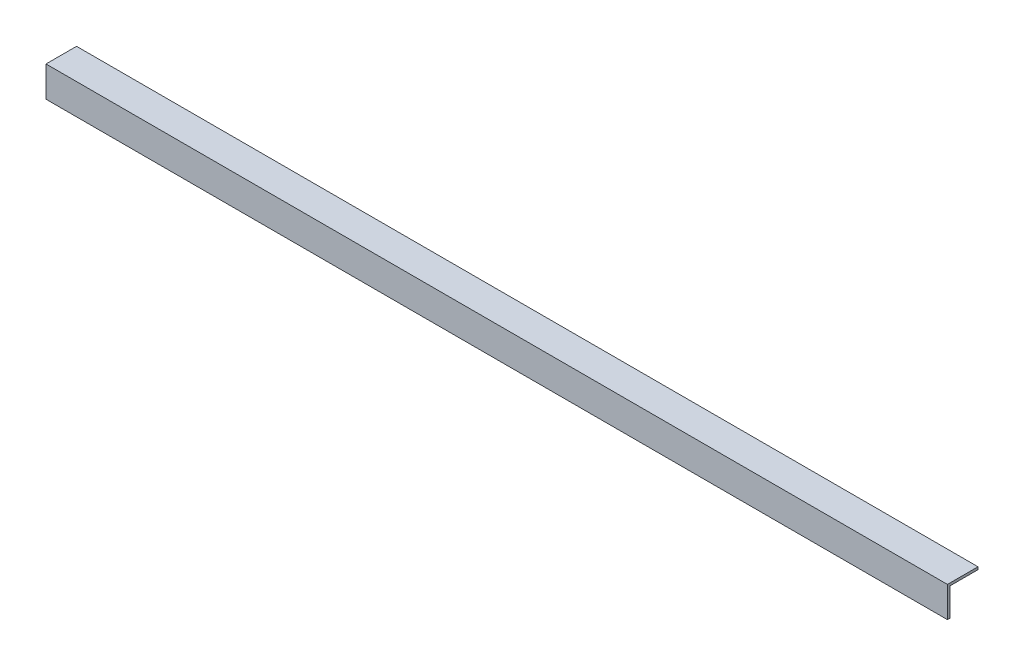
ISO-10303-21;
HEADER;
FILE_DESCRIPTION(('STEP AP214'),'2;1');
FILE_NAME('part.step','',(''),(''),'','','');
FILE_SCHEMA(('AUTOMOTIVE_DESIGN { 1 0 10303 214 1 1 1 1 }'));
ENDSEC;
DATA;
#1=APPLICATION_CONTEXT('core data for automotive mechanical design processes');
#2=APPLICATION_PROTOCOL_DEFINITION('international standard','automotive_design',2000,#1);
#3=PRODUCT_CONTEXT('',#1,'mechanical');
#4=PRODUCT('Part','Part','',(#3));
#5=PRODUCT_RELATED_PRODUCT_CATEGORY('part','',(#4));
#6=PRODUCT_DEFINITION_FORMATION('','',#4);
#7=PRODUCT_DEFINITION_CONTEXT('part definition',#1,'design');
#8=PRODUCT_DEFINITION('design','',#6,#7);
#9=PRODUCT_DEFINITION_SHAPE('','',#8);
#10=(LENGTH_UNIT() NAMED_UNIT(*) SI_UNIT(.MILLI.,.METRE.));
#11=(NAMED_UNIT(*) PLANE_ANGLE_UNIT() SI_UNIT($,.RADIAN.));
#12=(NAMED_UNIT(*) SI_UNIT($,.STERADIAN.) SOLID_ANGLE_UNIT());
#13=UNCERTAINTY_MEASURE_WITH_UNIT(LENGTH_MEASURE(1.E-05),#10,'distance_accuracy_value','');
#14=(GEOMETRIC_REPRESENTATION_CONTEXT(3) GLOBAL_UNCERTAINTY_ASSIGNED_CONTEXT((#13)) GLOBAL_UNIT_ASSIGNED_CONTEXT((#10,
#11,#12)) REPRESENTATION_CONTEXT('',''));
#15=CARTESIAN_POINT('',(0.,0.,0.));
#16=DIRECTION('',(0.,0.,1.));
#17=DIRECTION('',(1.,0.,0.));
#18=AXIS2_PLACEMENT_3D('',#15,#16,#17);
#19=CARTESIAN_POINT('',(-561.975,-38.1,-3.175));
#20=DIRECTION('',(0.,0.,-1.));
#21=DIRECTION('',(-1.,0.,0.));
#22=AXIS2_PLACEMENT_3D('',#19,#20,#21);
#23=PLANE('',#22);
#24=DIRECTION('',(1.,0.,0.));
#25=VECTOR('',#24,1.);
#26=CARTESIAN_POINT('',(-561.975,-38.1,-3.175));
#27=LINE('',#26,#25);
#28=CARTESIAN_POINT('',(-561.975,-38.1,-3.175));
#29=VERTEX_POINT('',#28);
#30=CARTESIAN_POINT('',(561.975,-38.1,-3.175));
#31=VERTEX_POINT('',#30);
#32=EDGE_CURVE('E72',#29,#31,#27,.T.);
#33=ORIENTED_EDGE('',*,*,#32,.F.);
#34=DIRECTION('',(0.,1.,0.));
#35=VECTOR('',#34,1.);
#36=CARTESIAN_POINT('',(-561.975,0.,-3.175));
#37=LINE('',#36,#35);
#38=CARTESIAN_POINT('',(-561.975,-3.175,-3.175));
#39=VERTEX_POINT('',#38);
#40=EDGE_CURVE('E104',#29,#39,#37,.T.);
#41=ORIENTED_EDGE('',*,*,#40,.T.);
#42=DIRECTION('',(1.,0.,0.));
#43=VECTOR('',#42,1.);
#44=CARTESIAN_POINT('',(-561.975,-3.175,-3.175));
#45=LINE('',#44,#43);
#46=CARTESIAN_POINT('',(561.975,-3.175,-3.175));
#47=VERTEX_POINT('',#46);
#48=EDGE_CURVE('E20',#47,#39,#45,.F.);
#49=ORIENTED_EDGE('',*,*,#48,.F.);
#50=DIRECTION('',(0.,1.,0.));
#51=VECTOR('',#50,1.);
#52=CARTESIAN_POINT('',(561.975,0.,-3.175));
#53=LINE('',#52,#51);
#54=EDGE_CURVE('E83',#31,#47,#53,.T.);
#55=ORIENTED_EDGE('',*,*,#54,.F.);
#56=EDGE_LOOP('',(#33,#41,#49,#55));
#57=FACE_BOUND('',#56,.T.);
#58=ADVANCED_FACE('F17',(#57),#23,.T.);
#59=CARTESIAN_POINT('',(-561.975,-3.175,-3.175));
#60=DIRECTION('',(0.,-1.,0.));
#61=DIRECTION('',(0.,0.,-1.));
#62=AXIS2_PLACEMENT_3D('',#59,#60,#61);
#63=PLANE('',#62);
#64=ORIENTED_EDGE('',*,*,#48,.T.);
#65=DIRECTION('',(0.,0.,-1.));
#66=VECTOR('',#65,1.);
#67=CARTESIAN_POINT('',(-561.975,-3.175,0.));
#68=LINE('',#67,#66);
#69=CARTESIAN_POINT('',(-561.975,-3.175,-38.1));
#70=VERTEX_POINT('',#69);
#71=EDGE_CURVE('E101',#39,#70,#68,.T.);
#72=ORIENTED_EDGE('',*,*,#71,.T.);
#73=DIRECTION('',(-1.,0.,0.));
#74=VECTOR('',#73,1.);
#75=CARTESIAN_POINT('',(-561.975,-3.175,-38.1));
#76=LINE('',#75,#74);
#77=CARTESIAN_POINT('',(561.975,-3.175,-38.1));
#78=VERTEX_POINT('',#77);
#79=EDGE_CURVE('E80',#78,#70,#76,.T.);
#80=ORIENTED_EDGE('',*,*,#79,.F.);
#81=DIRECTION('',(0.,0.,-1.));
#82=VECTOR('',#81,1.);
#83=CARTESIAN_POINT('',(561.975,-3.175,0.));
#84=LINE('',#83,#82);
#85=EDGE_CURVE('E86',#47,#78,#84,.T.);
#86=ORIENTED_EDGE('',*,*,#85,.F.);
#87=EDGE_LOOP('',(#64,#72,#80,#86));
#88=FACE_BOUND('',#87,.T.);
#89=ADVANCED_FACE('F100',(#88),#63,.T.);
#90=CARTESIAN_POINT('',(-561.975,-3.175,-38.1));
#91=DIRECTION('',(0.,0.,-1.));
#92=DIRECTION('',(-1.,0.,0.));
#93=AXIS2_PLACEMENT_3D('',#90,#91,#92);
#94=PLANE('',#93);
#95=ORIENTED_EDGE('',*,*,#79,.T.);
#96=DIRECTION('',(0.,1.,0.));
#97=VECTOR('',#96,1.);
#98=CARTESIAN_POINT('',(-561.975,0.,-38.1));
#99=LINE('',#98,#97);
#100=CARTESIAN_POINT('',(-561.975,0.,-38.1));
#101=VERTEX_POINT('',#100);
#102=EDGE_CURVE('E105',#70,#101,#99,.T.);
#103=ORIENTED_EDGE('',*,*,#102,.T.);
#104=DIRECTION('',(1.,0.,0.));
#105=VECTOR('',#104,1.);
#106=CARTESIAN_POINT('',(-561.975,0.,-38.1));
#107=LINE('',#106,#105);
#108=CARTESIAN_POINT('',(561.975,0.,-38.1));
#109=VERTEX_POINT('',#108);
#110=EDGE_CURVE('E112',#109,#101,#107,.F.);
#111=ORIENTED_EDGE('',*,*,#110,.F.);
#112=DIRECTION('',(0.,1.,0.));
#113=VECTOR('',#112,1.);
#114=CARTESIAN_POINT('',(561.975,0.,-38.1));
#115=LINE('',#114,#113);
#116=EDGE_CURVE('E117',#78,#109,#115,.T.);
#117=ORIENTED_EDGE('',*,*,#116,.F.);
#118=EDGE_LOOP('',(#95,#103,#111,#117));
#119=FACE_BOUND('',#118,.T.);
#120=ADVANCED_FACE('F119',(#119),#94,.T.);
#121=CARTESIAN_POINT('',(-561.975,-38.1,0.));
#122=DIRECTION('',(0.,-1.,0.));
#123=DIRECTION('',(0.,0.,-1.));
#124=AXIS2_PLACEMENT_3D('',#121,#122,#123);
#125=PLANE('',#124);
#126=DIRECTION('',(1.,0.,0.));
#127=VECTOR('',#126,1.);
#128=CARTESIAN_POINT('',(-561.975,-38.1,0.));
#129=LINE('',#128,#127);
#130=CARTESIAN_POINT('',(-561.975,-38.1,0.));
#131=VERTEX_POINT('',#130);
#132=CARTESIAN_POINT('',(561.975,-38.1,0.));
#133=VERTEX_POINT('',#132);
#134=EDGE_CURVE('E125',#131,#133,#129,.T.);
#135=ORIENTED_EDGE('',*,*,#134,.F.);
#136=DIRECTION('',(0.,0.,-1.));
#137=VECTOR('',#136,1.);
#138=CARTESIAN_POINT('',(-561.975,-38.1,0.));
#139=LINE('',#138,#137);
#140=EDGE_CURVE('E78',#131,#29,#139,.T.);
#141=ORIENTED_EDGE('',*,*,#140,.T.);
#142=ORIENTED_EDGE('',*,*,#32,.T.);
#143=DIRECTION('',(0.,0.,-1.));
#144=VECTOR('',#143,1.);
#145=CARTESIAN_POINT('',(561.975,-38.1,0.));
#146=LINE('',#145,#144);
#147=EDGE_CURVE('E75',#133,#31,#146,.T.);
#148=ORIENTED_EDGE('',*,*,#147,.F.);
#149=EDGE_LOOP('',(#135,#141,#142,#148));
#150=FACE_BOUND('',#149,.T.);
#151=ADVANCED_FACE('F73',(#150),#125,.T.);
#152=CARTESIAN_POINT('',(561.975,0.,0.));
#153=DIRECTION('',(1.,0.,0.));
#154=DIRECTION('',(0.,0.,-1.));
#155=AXIS2_PLACEMENT_3D('',#152,#153,#154);
#156=PLANE('',#155);
#157=DIRECTION('',(0.,0.,1.));
#158=VECTOR('',#157,1.);
#159=CARTESIAN_POINT('',(561.975,0.,-38.1));
#160=LINE('',#159,#158);
#161=CARTESIAN_POINT('',(561.975,0.,0.));
#162=VERTEX_POINT('',#161);
#163=EDGE_CURVE('E114',#162,#109,#160,.F.);
#164=ORIENTED_EDGE('',*,*,#163,.F.);
#165=DIRECTION('',(0.,1.,0.));
#166=VECTOR('',#165,1.);
#167=CARTESIAN_POINT('',(561.975,0.,0.));
#168=LINE('',#167,#166);
#169=EDGE_CURVE('E90',#133,#162,#168,.T.);
#170=ORIENTED_EDGE('',*,*,#169,.F.);
#171=ORIENTED_EDGE('',*,*,#147,.T.);
#172=ORIENTED_EDGE('',*,*,#54,.T.);
#173=ORIENTED_EDGE('',*,*,#85,.T.);
#174=ORIENTED_EDGE('',*,*,#116,.T.);
#175=EDGE_LOOP('',(#164,#170,#171,#172,#173,#174));
#176=FACE_BOUND('',#175,.T.);
#177=ADVANCED_FACE('F88',(#176),#156,.T.);
#178=CARTESIAN_POINT('',(-561.975,0.,-38.1));
#179=DIRECTION('',(0.,1.,0.));
#180=DIRECTION('',(0.,0.,1.));
#181=AXIS2_PLACEMENT_3D('',#178,#179,#180);
#182=PLANE('',#181);
#183=ORIENTED_EDGE('',*,*,#110,.T.);
#184=DIRECTION('',(0.,0.,-1.));
#185=VECTOR('',#184,1.);
#186=CARTESIAN_POINT('',(-561.975,0.,0.));
#187=LINE('',#186,#185);
#188=CARTESIAN_POINT('',(-561.975,0.,0.));
#189=VERTEX_POINT('',#188);
#190=EDGE_CURVE('E35',#101,#189,#187,.F.);
#191=ORIENTED_EDGE('',*,*,#190,.T.);
#192=DIRECTION('',(1.,0.,0.));
#193=VECTOR('',#192,1.);
#194=CARTESIAN_POINT('',(-561.975,0.,0.));
#195=LINE('',#194,#193);
#196=EDGE_CURVE('E26',#162,#189,#195,.F.);
#197=ORIENTED_EDGE('',*,*,#196,.F.);
#198=ORIENTED_EDGE('',*,*,#163,.T.);
#199=EDGE_LOOP('',(#183,#191,#197,#198));
#200=FACE_BOUND('',#199,.T.);
#201=ADVANCED_FACE('F120',(#200),#182,.T.);
#202=CARTESIAN_POINT('',(-561.975,0.,0.));
#203=DIRECTION('',(1.,0.,0.));
#204=DIRECTION('',(0.,0.,-1.));
#205=AXIS2_PLACEMENT_3D('',#202,#203,#204);
#206=PLANE('',#205);
#207=ORIENTED_EDGE('',*,*,#102,.F.);
#208=ORIENTED_EDGE('',*,*,#71,.F.);
#209=ORIENTED_EDGE('',*,*,#40,.F.);
#210=ORIENTED_EDGE('',*,*,#140,.F.);
#211=DIRECTION('',(0.,1.,0.));
#212=VECTOR('',#211,1.);
#213=CARTESIAN_POINT('',(-561.975,0.,0.));
#214=LINE('',#213,#212);
#215=EDGE_CURVE('E11',#189,#131,#214,.F.);
#216=ORIENTED_EDGE('',*,*,#215,.F.);
#217=ORIENTED_EDGE('',*,*,#190,.F.);
#218=EDGE_LOOP('',(#207,#208,#209,#210,#216,#217));
#219=FACE_BOUND('',#218,.T.);
#220=ADVANCED_FACE('F103',(#219),#206,.F.);
#221=CARTESIAN_POINT('',(-561.975,0.,0.));
#222=DIRECTION('',(0.,0.,1.));
#223=DIRECTION('',(1.,0.,0.));
#224=AXIS2_PLACEMENT_3D('',#221,#222,#223);
#225=PLANE('',#224);
#226=ORIENTED_EDGE('',*,*,#196,.T.);
#227=ORIENTED_EDGE('',*,*,#215,.T.);
#228=ORIENTED_EDGE('',*,*,#134,.T.);
#229=ORIENTED_EDGE('',*,*,#169,.T.);
#230=EDGE_LOOP('',(#226,#227,#228,#229));
#231=FACE_BOUND('',#230,.T.);
#232=ADVANCED_FACE('F124',(#231),#225,.T.);
#233=CLOSED_SHELL('',(#58,#89,#120,#151,#177,#201,#220,#232));
#234=MANIFOLD_SOLID_BREP('B1',#233);
#235=ADVANCED_BREP_SHAPE_REPRESENTATION('',(#18,#234),#14);
#236=SHAPE_DEFINITION_REPRESENTATION(#9,#235);
ENDSEC;
END-ISO-10303-21;
